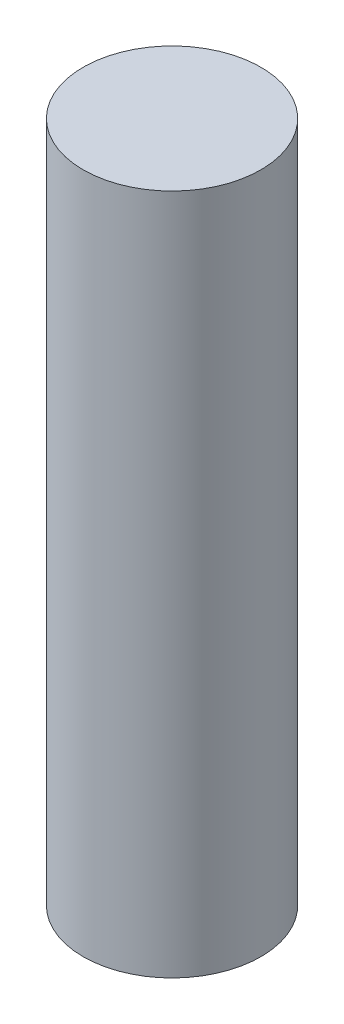
ISO-10303-21;
HEADER;
FILE_DESCRIPTION(('STEP AP214'),'2;1');
FILE_NAME('part.step','',(''),(''),'','','');
FILE_SCHEMA(('AUTOMOTIVE_DESIGN { 1 0 10303 214 1 1 1 1 }'));
ENDSEC;
DATA;
#1=APPLICATION_CONTEXT('core data for automotive mechanical design processes');
#2=APPLICATION_PROTOCOL_DEFINITION('international standard','automotive_design',2000,#1);
#3=PRODUCT_CONTEXT('',#1,'mechanical');
#4=PRODUCT('Part','Part','',(#3));
#5=PRODUCT_RELATED_PRODUCT_CATEGORY('part','',(#4));
#6=PRODUCT_DEFINITION_FORMATION('','',#4);
#7=PRODUCT_DEFINITION_CONTEXT('part definition',#1,'design');
#8=PRODUCT_DEFINITION('design','',#6,#7);
#9=PRODUCT_DEFINITION_SHAPE('','',#8);
#10=(LENGTH_UNIT() NAMED_UNIT(*) SI_UNIT(.MILLI.,.METRE.));
#11=(NAMED_UNIT(*) PLANE_ANGLE_UNIT() SI_UNIT($,.RADIAN.));
#12=(NAMED_UNIT(*) SI_UNIT($,.STERADIAN.) SOLID_ANGLE_UNIT());
#13=UNCERTAINTY_MEASURE_WITH_UNIT(LENGTH_MEASURE(1.E-05),#10,'distance_accuracy_value','');
#14=(GEOMETRIC_REPRESENTATION_CONTEXT(3) GLOBAL_UNCERTAINTY_ASSIGNED_CONTEXT((#13)) GLOBAL_UNIT_ASSIGNED_CONTEXT((#10,
#11,#12)) REPRESENTATION_CONTEXT('',''));
#15=CARTESIAN_POINT('',(0.,0.,0.));
#16=DIRECTION('',(0.,0.,1.));
#17=DIRECTION('',(1.,0.,0.));
#18=AXIS2_PLACEMENT_3D('',#15,#16,#17);
#19=CARTESIAN_POINT('',(0.,30.48,0.));
#20=DIRECTION('',(0.,-1.,0.));
#21=DIRECTION('',(0.,0.,-1.));
#22=AXIS2_PLACEMENT_3D('',#19,#20,#21);
#23=CYLINDRICAL_SURFACE('',#22,3.9751);
#24=CARTESIAN_POINT('',(0.,30.48,0.));
#25=DIRECTION('',(0.,1.,0.));
#26=DIRECTION('',(0.,0.,1.));
#27=AXIS2_PLACEMENT_3D('',#24,#25,#26);
#28=CIRCLE('',#27,3.9751);
#29=CARTESIAN_POINT('',(0.,30.48,3.9751));
#30=VERTEX_POINT('',#29);
#31=EDGE_CURVE('E10',#30,#30,#28,.T.);
#32=ORIENTED_EDGE('',*,*,#31,.F.);
#33=EDGE_LOOP('',(#32));
#34=FACE_BOUND('',#33,.T.);
#35=CARTESIAN_POINT('',(0.,0.,0.));
#36=DIRECTION('',(0.,1.,0.));
#37=DIRECTION('',(0.,0.,1.));
#38=AXIS2_PLACEMENT_3D('',#35,#36,#37);
#39=CIRCLE('',#38,3.9751);
#40=CARTESIAN_POINT('',(0.,0.,3.9751));
#41=VERTEX_POINT('',#40);
#42=EDGE_CURVE('E40',#41,#41,#39,.T.);
#43=ORIENTED_EDGE('',*,*,#42,.T.);
#44=EDGE_LOOP('',(#43));
#45=FACE_BOUND('',#44,.T.);
#46=ADVANCED_FACE('F37',(#34,#45),#23,.T.);
#47=CARTESIAN_POINT('',(0.,30.48,0.));
#48=DIRECTION('',(0.,1.,0.));
#49=DIRECTION('',(0.,0.,1.));
#50=AXIS2_PLACEMENT_3D('',#47,#48,#49);
#51=PLANE('',#50);
#52=ORIENTED_EDGE('',*,*,#31,.T.);
#53=EDGE_LOOP('',(#52));
#54=FACE_BOUND('',#53,.T.);
#55=ADVANCED_FACE('F54',(#54),#51,.T.);
#56=CARTESIAN_POINT('',(0.,0.,0.));
#57=DIRECTION('',(0.,1.,0.));
#58=DIRECTION('',(0.,0.,1.));
#59=AXIS2_PLACEMENT_3D('',#56,#57,#58);
#60=PLANE('',#59);
#61=ORIENTED_EDGE('',*,*,#42,.F.);
#62=EDGE_LOOP('',(#61));
#63=FACE_BOUND('',#62,.T.);
#64=ADVANCED_FACE('F52',(#63),#60,.F.);
#65=CLOSED_SHELL('',(#46,#55,#64));
#66=MANIFOLD_SOLID_BREP('B2',#65);
#67=ADVANCED_BREP_SHAPE_REPRESENTATION('',(#18,#66),#14);
#68=SHAPE_DEFINITION_REPRESENTATION(#9,#67);
ENDSEC;
END-ISO-10303-21;
